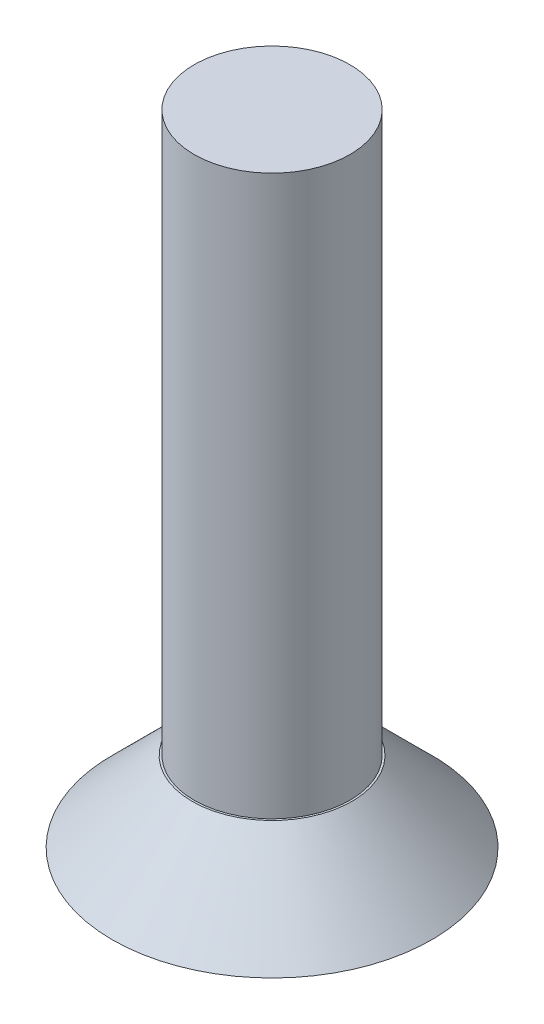
ISO-10303-21;
HEADER;
FILE_DESCRIPTION(('STEP AP214'),'2;1');
FILE_NAME('part.step','',(''),(''),'','','');
FILE_SCHEMA(('AUTOMOTIVE_DESIGN { 1 0 10303 214 1 1 1 1 }'));
ENDSEC;
DATA;
#1=APPLICATION_CONTEXT('core data for automotive mechanical design processes');
#2=APPLICATION_PROTOCOL_DEFINITION('international standard','automotive_design',2000,#1);
#3=PRODUCT_CONTEXT('',#1,'mechanical');
#4=PRODUCT('Part','Part','',(#3));
#5=PRODUCT_RELATED_PRODUCT_CATEGORY('part','',(#4));
#6=PRODUCT_DEFINITION_FORMATION('','',#4);
#7=PRODUCT_DEFINITION_CONTEXT('part definition',#1,'design');
#8=PRODUCT_DEFINITION('design','',#6,#7);
#9=PRODUCT_DEFINITION_SHAPE('','',#8);
#10=(LENGTH_UNIT() NAMED_UNIT(*) SI_UNIT(.MILLI.,.METRE.));
#11=(NAMED_UNIT(*) PLANE_ANGLE_UNIT() SI_UNIT($,.RADIAN.));
#12=(NAMED_UNIT(*) SI_UNIT($,.STERADIAN.) SOLID_ANGLE_UNIT());
#13=UNCERTAINTY_MEASURE_WITH_UNIT(LENGTH_MEASURE(1.E-05),#10,'distance_accuracy_value','');
#14=(GEOMETRIC_REPRESENTATION_CONTEXT(3) GLOBAL_UNCERTAINTY_ASSIGNED_CONTEXT((#13)) GLOBAL_UNIT_ASSIGNED_CONTEXT((#10,
#11,#12)) REPRESENTATION_CONTEXT('',''));
#15=CARTESIAN_POINT('',(0.,0.,0.));
#16=DIRECTION('',(0.,0.,1.));
#17=DIRECTION('',(1.,0.,0.));
#18=AXIS2_PLACEMENT_3D('',#15,#16,#17);
#19=CARTESIAN_POINT('',(0.,2.,0.));
#20=DIRECTION('',(0.,1.,0.));
#21=DIRECTION('',(0.,0.,1.));
#22=AXIS2_PLACEMENT_3D('',#19,#20,#21);
#23=PLANE('',#22);
#24=CARTESIAN_POINT('',(0.,2.,0.));
#25=DIRECTION('',(0.,1.,0.));
#26=DIRECTION('',(0.,0.,1.));
#27=AXIS2_PLACEMENT_3D('',#24,#25,#26);
#28=CIRCLE('',#27,2.00000000000001);
#29=CARTESIAN_POINT('',(0.,2.,2.00000000000001));
#30=VERTEX_POINT('',#29);
#31=EDGE_CURVE('E11',#30,#30,#28,.T.);
#32=ORIENTED_EDGE('',*,*,#31,.T.);
#33=EDGE_LOOP('',(#32));
#34=FACE_BOUND('',#33,.T.);
#35=CARTESIAN_POINT('',(0.,2.,0.));
#36=DIRECTION('',(0.,1.,0.));
#37=DIRECTION('',(0.,0.,1.));
#38=AXIS2_PLACEMENT_3D('',#35,#36,#37);
#39=CIRCLE('',#38,1.95);
#40=CARTESIAN_POINT('',(0.,2.,1.95));
#41=VERTEX_POINT('',#40);
#42=EDGE_CURVE('E44',#41,#41,#39,.T.);
#43=ORIENTED_EDGE('',*,*,#42,.F.);
#44=EDGE_LOOP('',(#43));
#45=FACE_BOUND('',#44,.T.);
#46=ADVANCED_FACE('F35',(#34,#45),#23,.T.);
#47=CARTESIAN_POINT('',(0.,0.,0.));
#48=DIRECTION('',(0.,1.,0.));
#49=DIRECTION('',(0.,0.,1.));
#50=AXIS2_PLACEMENT_3D('',#47,#48,#49);
#51=PLANE('',#50);
#52=DIRECTION('',(0.866025403784438,0.,0.500000000000001));
#53=VECTOR('',#52,1.);
#54=CARTESIAN_POINT('',(0.,0.,-1.66247090152183));
#55=LINE('',#54,#53);
#56=CARTESIAN_POINT('',(0.,0.,-1.66247090152183));
#57=VERTEX_POINT('',#56);
#58=CARTESIAN_POINT('',(1.43974203377032,0.,-0.831235450760911));
#59=VERTEX_POINT('',#58);
#60=EDGE_CURVE('E125',#57,#59,#55,.T.);
#61=ORIENTED_EDGE('',*,*,#60,.F.);
#62=DIRECTION('',(0.866025403784441,0.,-0.499999999999995));
#63=VECTOR('',#62,1.);
#64=CARTESIAN_POINT('',(-1.43974203377031,0.,-0.831235450760931));
#65=LINE('',#64,#63);
#66=CARTESIAN_POINT('',(-1.43974203377031,0.,-0.831235450760931));
#67=VERTEX_POINT('',#66);
#68=EDGE_CURVE('E51',#67,#57,#65,.T.);
#69=ORIENTED_EDGE('',*,*,#68,.F.);
#70=DIRECTION('',(0.,0.,-1.));
#71=VECTOR('',#70,1.);
#72=CARTESIAN_POINT('',(-1.43974203377033,0.,0.831235450760901));
#73=LINE('',#72,#71);
#74=CARTESIAN_POINT('',(-1.43974203377033,0.,0.831235450760901));
#75=VERTEX_POINT('',#74);
#76=EDGE_CURVE('E134',#75,#67,#73,.T.);
#77=ORIENTED_EDGE('',*,*,#76,.F.);
#78=DIRECTION('',(-0.866025403784434,0.,-0.500000000000007));
#79=VECTOR('',#78,1.);
#80=CARTESIAN_POINT('',(0.,0.,1.66247090152183));
#81=LINE('',#80,#79);
#82=CARTESIAN_POINT('',(0.,0.,1.66247090152183));
#83=VERTEX_POINT('',#82);
#84=EDGE_CURVE('E132',#83,#75,#81,.T.);
#85=ORIENTED_EDGE('',*,*,#84,.F.);
#86=DIRECTION('',(-0.866025403784442,0.,0.499999999999995));
#87=VECTOR('',#86,1.);
#88=CARTESIAN_POINT('',(1.43974203377032,0.,0.831235450760921));
#89=LINE('',#88,#87);
#90=CARTESIAN_POINT('',(1.43974203377032,0.,0.831235450760921));
#91=VERTEX_POINT('',#90);
#92=EDGE_CURVE('E99',#91,#83,#89,.T.);
#93=ORIENTED_EDGE('',*,*,#92,.F.);
#94=DIRECTION('',(0.,0.,1.));
#95=VECTOR('',#94,1.);
#96=CARTESIAN_POINT('',(1.43974203377032,0.,-0.831235450760911));
#97=LINE('',#96,#95);
#98=EDGE_CURVE('E128',#59,#91,#97,.T.);
#99=ORIENTED_EDGE('',*,*,#98,.F.);
#100=EDGE_LOOP('',(#61,#69,#77,#85,#93,#99));
#101=FACE_BOUND('',#100,.T.);
#102=CARTESIAN_POINT('',(0.,0.,0.));
#103=DIRECTION('',(0.,1.,0.));
#104=DIRECTION('',(0.,0.,1.));
#105=AXIS2_PLACEMENT_3D('',#102,#103,#104);
#106=CIRCLE('',#105,4.);
#107=CARTESIAN_POINT('',(0.,0.,4.));
#108=VERTEX_POINT('',#107);
#109=EDGE_CURVE('E146',#108,#108,#106,.T.);
#110=ORIENTED_EDGE('',*,*,#109,.F.);
#111=EDGE_LOOP('',(#110));
#112=FACE_BOUND('',#111,.T.);
#113=ADVANCED_FACE('F153',(#101,#112),#51,.F.);
#114=CARTESIAN_POINT('',(0.,16.,0.));
#115=DIRECTION('',(0.,-1.,0.));
#116=DIRECTION('',(0.,0.,-1.));
#117=AXIS2_PLACEMENT_3D('',#114,#115,#116);
#118=CYLINDRICAL_SURFACE('',#117,1.95);
#119=CARTESIAN_POINT('',(0.,16.,0.));
#120=DIRECTION('',(0.,1.,0.));
#121=DIRECTION('',(0.,0.,1.));
#122=AXIS2_PLACEMENT_3D('',#119,#120,#121);
#123=CIRCLE('',#122,1.95);
#124=CARTESIAN_POINT('',(0.,16.,1.95));
#125=VERTEX_POINT('',#124);
#126=EDGE_CURVE('E138',#125,#125,#123,.T.);
#127=ORIENTED_EDGE('',*,*,#126,.F.);
#128=EDGE_LOOP('',(#127));
#129=FACE_BOUND('',#128,.T.);
#130=ORIENTED_EDGE('',*,*,#42,.T.);
#131=EDGE_LOOP('',(#130));
#132=FACE_BOUND('',#131,.T.);
#133=ADVANCED_FACE('F155',(#129,#132),#118,.T.);
#134=CARTESIAN_POINT('',(0.,16.,0.));
#135=DIRECTION('',(0.,1.,0.));
#136=DIRECTION('',(0.,0.,1.));
#137=AXIS2_PLACEMENT_3D('',#134,#135,#136);
#138=PLANE('',#137);
#139=ORIENTED_EDGE('',*,*,#126,.T.);
#140=EDGE_LOOP('',(#139));
#141=FACE_BOUND('',#140,.T.);
#142=ADVANCED_FACE('F161',(#141),#138,.T.);
#143=CARTESIAN_POINT('',(0.,2.,0.));
#144=DIRECTION('',(0.,-1.,0.));
#145=DIRECTION('',(0.,0.,-1.));
#146=AXIS2_PLACEMENT_3D('',#143,#144,#145);
#147=CONICAL_SURFACE('',#146,2.00000000000001,0.785398163397446);
#148=ORIENTED_EDGE('',*,*,#109,.T.);
#149=EDGE_LOOP('',(#148));
#150=FACE_BOUND('',#149,.T.);
#151=ORIENTED_EDGE('',*,*,#31,.F.);
#152=EDGE_LOOP('',(#151));
#153=FACE_BOUND('',#152,.T.);
#154=ADVANCED_FACE('F38',(#150,#153),#147,.T.);
#155=CARTESIAN_POINT('',(-1.43974203377031,1.5,-0.831235450760931));
#156=DIRECTION('',(-0.499999999999995,0.,-0.866025403784441));
#157=DIRECTION('',(-0.866025403784441,0.,0.499999999999995));
#158=AXIS2_PLACEMENT_3D('',#155,#156,#157);
#159=PLANE('',#158);
#160=ORIENTED_EDGE('',*,*,#68,.T.);
#161=DIRECTION('',(0.,-1.,0.));
#162=VECTOR('',#161,1.);
#163=CARTESIAN_POINT('',(0.,1.5,-1.66247090152183));
#164=LINE('',#163,#162);
#165=CARTESIAN_POINT('',(0.,1.5,-1.66247090152183));
#166=VERTEX_POINT('',#165);
#167=EDGE_CURVE('E81',#166,#57,#164,.T.);
#168=ORIENTED_EDGE('',*,*,#167,.F.);
#169=DIRECTION('',(0.866025403784441,0.,-0.499999999999995));
#170=VECTOR('',#169,1.);
#171=CARTESIAN_POINT('',(-1.43974203377031,1.5,-0.831235450760931));
#172=LINE('',#171,#170);
#173=CARTESIAN_POINT('',(-1.43974203377031,1.5,-0.831235450760931));
#174=VERTEX_POINT('',#173);
#175=EDGE_CURVE('E136',#174,#166,#172,.T.);
#176=ORIENTED_EDGE('',*,*,#175,.F.);
#177=DIRECTION('',(0.,-1.,0.));
#178=VECTOR('',#177,1.);
#179=CARTESIAN_POINT('',(-1.43974203377031,1.5,-0.831235450760931));
#180=LINE('',#179,#178);
#181=EDGE_CURVE('E59',#174,#67,#180,.T.);
#182=ORIENTED_EDGE('',*,*,#181,.T.);
#183=EDGE_LOOP('',(#160,#168,#176,#182));
#184=FACE_BOUND('',#183,.T.);
#185=ADVANCED_FACE('F171',(#184),#159,.F.);
#186=CARTESIAN_POINT('',(-1.43974203377033,1.5,0.831235450760901));
#187=DIRECTION('',(-1.,0.,0.));
#188=DIRECTION('',(0.,0.,1.));
#189=AXIS2_PLACEMENT_3D('',#186,#187,#188);
#190=PLANE('',#189);
#191=ORIENTED_EDGE('',*,*,#76,.T.);
#192=ORIENTED_EDGE('',*,*,#181,.F.);
#193=DIRECTION('',(0.,0.,-1.));
#194=VECTOR('',#193,1.);
#195=CARTESIAN_POINT('',(-1.43974203377033,1.5,0.831235450760901));
#196=LINE('',#195,#194);
#197=CARTESIAN_POINT('',(-1.43974203377033,1.5,0.831235450760901));
#198=VERTEX_POINT('',#197);
#199=EDGE_CURVE('E111',#198,#174,#196,.T.);
#200=ORIENTED_EDGE('',*,*,#199,.F.);
#201=DIRECTION('',(0.,-1.,0.));
#202=VECTOR('',#201,1.);
#203=CARTESIAN_POINT('',(-1.43974203377033,1.5,0.831235450760901));
#204=LINE('',#203,#202);
#205=EDGE_CURVE('E103',#198,#75,#204,.T.);
#206=ORIENTED_EDGE('',*,*,#205,.T.);
#207=EDGE_LOOP('',(#191,#192,#200,#206));
#208=FACE_BOUND('',#207,.T.);
#209=ADVANCED_FACE('F174',(#208),#190,.F.);
#210=CARTESIAN_POINT('',(0.,1.5,1.66247090152183));
#211=DIRECTION('',(-0.500000000000007,0.,0.866025403784435));
#212=DIRECTION('',(0.866025403784434,0.,0.500000000000007));
#213=AXIS2_PLACEMENT_3D('',#210,#211,#212);
#214=PLANE('',#213);
#215=ORIENTED_EDGE('',*,*,#84,.T.);
#216=ORIENTED_EDGE('',*,*,#205,.F.);
#217=DIRECTION('',(-0.866025403784434,0.,-0.500000000000007));
#218=VECTOR('',#217,1.);
#219=CARTESIAN_POINT('',(0.,1.5,1.66247090152183));
#220=LINE('',#219,#218);
#221=CARTESIAN_POINT('',(0.,1.5,1.66247090152183));
#222=VERTEX_POINT('',#221);
#223=EDGE_CURVE('E107',#222,#198,#220,.T.);
#224=ORIENTED_EDGE('',*,*,#223,.F.);
#225=DIRECTION('',(0.,-1.,0.));
#226=VECTOR('',#225,1.);
#227=CARTESIAN_POINT('',(0.,1.5,1.66247090152183));
#228=LINE('',#227,#226);
#229=EDGE_CURVE('E92',#222,#83,#228,.T.);
#230=ORIENTED_EDGE('',*,*,#229,.T.);
#231=EDGE_LOOP('',(#215,#216,#224,#230));
#232=FACE_BOUND('',#231,.T.);
#233=ADVANCED_FACE('F108',(#232),#214,.F.);
#234=CARTESIAN_POINT('',(1.43974203377032,1.5,0.831235450760921));
#235=DIRECTION('',(0.499999999999995,0.,0.866025403784441));
#236=DIRECTION('',(0.866025403784442,0.,-0.499999999999995));
#237=AXIS2_PLACEMENT_3D('',#234,#235,#236);
#238=PLANE('',#237);
#239=ORIENTED_EDGE('',*,*,#92,.T.);
#240=ORIENTED_EDGE('',*,*,#229,.F.);
#241=DIRECTION('',(-0.866025403784442,0.,0.499999999999995));
#242=VECTOR('',#241,1.);
#243=CARTESIAN_POINT('',(1.43974203377032,1.5,0.831235450760921));
#244=LINE('',#243,#242);
#245=CARTESIAN_POINT('',(1.43974203377032,1.5,0.831235450760921));
#246=VERTEX_POINT('',#245);
#247=EDGE_CURVE('E96',#246,#222,#244,.T.);
#248=ORIENTED_EDGE('',*,*,#247,.F.);
#249=DIRECTION('',(0.,-1.,0.));
#250=VECTOR('',#249,1.);
#251=CARTESIAN_POINT('',(1.43974203377032,1.5,0.831235450760921));
#252=LINE('',#251,#250);
#253=EDGE_CURVE('E104',#246,#91,#252,.T.);
#254=ORIENTED_EDGE('',*,*,#253,.T.);
#255=EDGE_LOOP('',(#239,#240,#248,#254));
#256=FACE_BOUND('',#255,.T.);
#257=ADVANCED_FACE('F94',(#256),#238,.F.);
#258=CARTESIAN_POINT('',(1.43974203377032,1.5,-0.831235450760911));
#259=DIRECTION('',(1.,0.,0.));
#260=DIRECTION('',(0.,0.,-1.));
#261=AXIS2_PLACEMENT_3D('',#258,#259,#260);
#262=PLANE('',#261);
#263=ORIENTED_EDGE('',*,*,#98,.T.);
#264=ORIENTED_EDGE('',*,*,#253,.F.);
#265=DIRECTION('',(0.,0.,1.));
#266=VECTOR('',#265,1.);
#267=CARTESIAN_POINT('',(1.43974203377032,1.5,-0.831235450760911));
#268=LINE('',#267,#266);
#269=CARTESIAN_POINT('',(1.43974203377032,1.5,-0.831235450760911));
#270=VERTEX_POINT('',#269);
#271=EDGE_CURVE('E117',#270,#246,#268,.T.);
#272=ORIENTED_EDGE('',*,*,#271,.F.);
#273=DIRECTION('',(0.,-1.,0.));
#274=VECTOR('',#273,1.);
#275=CARTESIAN_POINT('',(1.43974203377032,1.5,-0.831235450760911));
#276=LINE('',#275,#274);
#277=EDGE_CURVE('E141',#270,#59,#276,.T.);
#278=ORIENTED_EDGE('',*,*,#277,.T.);
#279=EDGE_LOOP('',(#263,#264,#272,#278));
#280=FACE_BOUND('',#279,.T.);
#281=ADVANCED_FACE('F178',(#280),#262,.F.);
#282=CARTESIAN_POINT('',(0.,1.5,-1.66247090152183));
#283=DIRECTION('',(0.500000000000001,0.,-0.866025403784438));
#284=DIRECTION('',(-0.866025403784438,0.,-0.500000000000001));
#285=AXIS2_PLACEMENT_3D('',#282,#283,#284);
#286=PLANE('',#285);
#287=ORIENTED_EDGE('',*,*,#60,.T.);
#288=ORIENTED_EDGE('',*,*,#277,.F.);
#289=DIRECTION('',(0.866025403784438,0.,0.500000000000001));
#290=VECTOR('',#289,1.);
#291=CARTESIAN_POINT('',(0.,1.5,-1.66247090152183));
#292=LINE('',#291,#290);
#293=EDGE_CURVE('E119',#166,#270,#292,.T.);
#294=ORIENTED_EDGE('',*,*,#293,.F.);
#295=ORIENTED_EDGE('',*,*,#167,.T.);
#296=EDGE_LOOP('',(#287,#288,#294,#295));
#297=FACE_BOUND('',#296,.T.);
#298=ADVANCED_FACE('F175',(#297),#286,.F.);
#299=CARTESIAN_POINT('',(0.,1.5,0.));
#300=DIRECTION('',(0.,-1.,0.));
#301=DIRECTION('',(0.,0.,-1.));
#302=AXIS2_PLACEMENT_3D('',#299,#300,#301);
#303=PLANE('',#302);
#304=ORIENTED_EDGE('',*,*,#175,.T.);
#305=ORIENTED_EDGE('',*,*,#293,.T.);
#306=ORIENTED_EDGE('',*,*,#271,.T.);
#307=ORIENTED_EDGE('',*,*,#247,.T.);
#308=ORIENTED_EDGE('',*,*,#223,.T.);
#309=ORIENTED_EDGE('',*,*,#199,.T.);
#310=EDGE_LOOP('',(#304,#305,#306,#307,#308,#309));
#311=FACE_BOUND('',#310,.T.);
#312=ADVANCED_FACE('F114',(#311),#303,.T.);
#313=CLOSED_SHELL('',(#46,#113,#133,#142,#154,#185,#209,#233,#257,#281,#298,#312));
#314=MANIFOLD_SOLID_BREP('B2',#313);
#315=ADVANCED_BREP_SHAPE_REPRESENTATION('',(#18,#314),#14);
#316=SHAPE_DEFINITION_REPRESENTATION(#9,#315);
ENDSEC;
END-ISO-10303-21;
